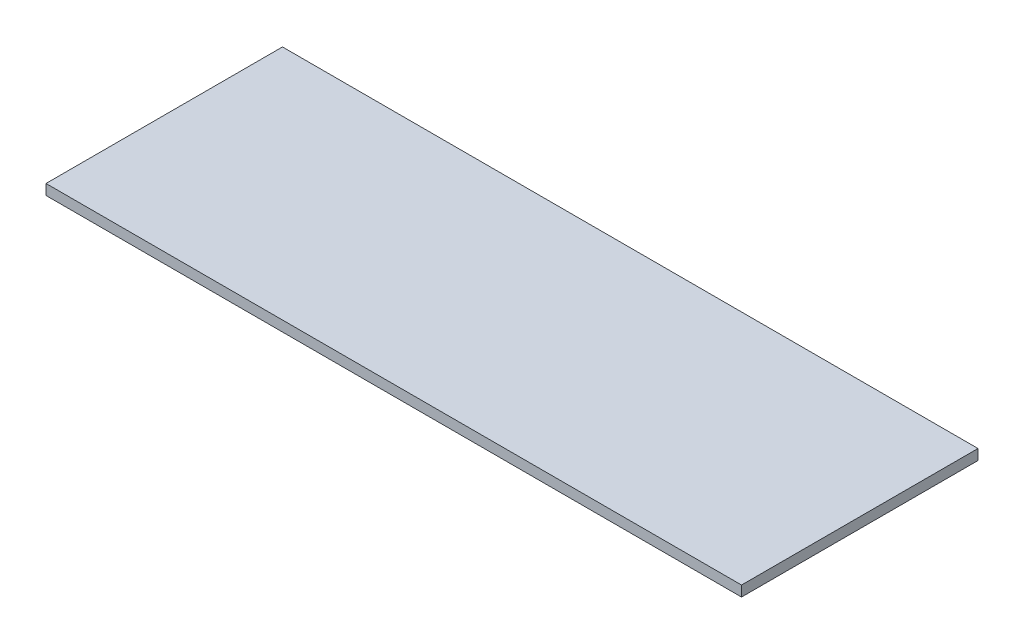
ISO-10303-21;
HEADER;
FILE_DESCRIPTION(('STEP AP214'),'2;1');
FILE_NAME('part.step','',(''),(''),'','','');
FILE_SCHEMA(('AUTOMOTIVE_DESIGN { 1 0 10303 214 1 1 1 1 }'));
ENDSEC;
DATA;
#1=APPLICATION_CONTEXT('core data for automotive mechanical design processes');
#2=APPLICATION_PROTOCOL_DEFINITION('international standard','automotive_design',2000,#1);
#3=PRODUCT_CONTEXT('',#1,'mechanical');
#4=PRODUCT('Part','Part','',(#3));
#5=PRODUCT_RELATED_PRODUCT_CATEGORY('part','',(#4));
#6=PRODUCT_DEFINITION_FORMATION('','',#4);
#7=PRODUCT_DEFINITION_CONTEXT('part definition',#1,'design');
#8=PRODUCT_DEFINITION('design','',#6,#7);
#9=PRODUCT_DEFINITION_SHAPE('','',#8);
#10=(LENGTH_UNIT() NAMED_UNIT(*) SI_UNIT(.MILLI.,.METRE.));
#11=(NAMED_UNIT(*) PLANE_ANGLE_UNIT() SI_UNIT($,.RADIAN.));
#12=(NAMED_UNIT(*) SI_UNIT($,.STERADIAN.) SOLID_ANGLE_UNIT());
#13=UNCERTAINTY_MEASURE_WITH_UNIT(LENGTH_MEASURE(1.E-05),#10,'distance_accuracy_value','');
#14=(GEOMETRIC_REPRESENTATION_CONTEXT(3) GLOBAL_UNCERTAINTY_ASSIGNED_CONTEXT((#13)) GLOBAL_UNIT_ASSIGNED_CONTEXT((#10,
#11,#12)) REPRESENTATION_CONTEXT('',''));
#15=CARTESIAN_POINT('',(0.,0.,0.));
#16=DIRECTION('',(0.,0.,1.));
#17=DIRECTION('',(1.,0.,0.));
#18=AXIS2_PLACEMENT_3D('',#15,#16,#17);
#19=CARTESIAN_POINT('',(-123.083700440529,3.81,-60.9823788546255));
#20=DIRECTION('',(1.,0.,0.));
#21=DIRECTION('',(0.,0.,-1.));
#22=AXIS2_PLACEMENT_3D('',#19,#20,#21);
#23=PLANE('',#22);
#24=DIRECTION('',(0.,0.,1.));
#25=VECTOR('',#24,1.);
#26=CARTESIAN_POINT('',(-123.083700440529,0.,-60.9823788546255));
#27=LINE('',#26,#25);
#28=CARTESIAN_POINT('',(-123.083700440529,0.,-60.9823788546255));
#29=VERTEX_POINT('',#28);
#30=CARTESIAN_POINT('',(-123.083700440529,0.,25.3776211453744));
#31=VERTEX_POINT('',#30);
#32=EDGE_CURVE('E96',#29,#31,#27,.T.);
#33=ORIENTED_EDGE('',*,*,#32,.T.);
#34=DIRECTION('',(0.,-1.,0.));
#35=VECTOR('',#34,1.);
#36=CARTESIAN_POINT('',(-123.083700440529,3.81,25.3776211453744));
#37=LINE('',#36,#35);
#38=CARTESIAN_POINT('',(-123.083700440529,3.81,25.3776211453744));
#39=VERTEX_POINT('',#38);
#40=EDGE_CURVE('E11',#39,#31,#37,.T.);
#41=ORIENTED_EDGE('',*,*,#40,.F.);
#42=DIRECTION('',(0.,0.,1.));
#43=VECTOR('',#42,1.);
#44=CARTESIAN_POINT('',(-123.083700440529,3.81,-60.9823788546255));
#45=LINE('',#44,#43);
#46=CARTESIAN_POINT('',(-123.083700440529,3.81,-60.9823788546255));
#47=VERTEX_POINT('',#46);
#48=EDGE_CURVE('E82',#47,#39,#45,.T.);
#49=ORIENTED_EDGE('',*,*,#48,.F.);
#50=DIRECTION('',(0.,-1.,0.));
#51=VECTOR('',#50,1.);
#52=CARTESIAN_POINT('',(-123.083700440529,3.81,-60.9823788546255));
#53=LINE('',#52,#51);
#54=EDGE_CURVE('E49',#47,#29,#53,.T.);
#55=ORIENTED_EDGE('',*,*,#54,.T.);
#56=EDGE_LOOP('',(#33,#41,#49,#55));
#57=FACE_BOUND('',#56,.T.);
#58=ADVANCED_FACE('F33',(#57),#23,.F.);
#59=CARTESIAN_POINT('',(-123.083700440529,3.81,25.3776211453744));
#60=DIRECTION('',(0.,0.,-1.));
#61=DIRECTION('',(-1.,0.,0.));
#62=AXIS2_PLACEMENT_3D('',#59,#60,#61);
#63=PLANE('',#62);
#64=DIRECTION('',(1.,0.,0.));
#65=VECTOR('',#64,1.);
#66=CARTESIAN_POINT('',(-123.083700440529,0.,25.3776211453744));
#67=LINE('',#66,#65);
#68=CARTESIAN_POINT('',(130.916299559471,0.,25.3776211453744));
#69=VERTEX_POINT('',#68);
#70=EDGE_CURVE('E87',#31,#69,#67,.T.);
#71=ORIENTED_EDGE('',*,*,#70,.T.);
#72=DIRECTION('',(0.,-1.,0.));
#73=VECTOR('',#72,1.);
#74=CARTESIAN_POINT('',(130.916299559471,3.81,25.3776211453744));
#75=LINE('',#74,#73);
#76=CARTESIAN_POINT('',(130.916299559471,3.81,25.3776211453744));
#77=VERTEX_POINT('',#76);
#78=EDGE_CURVE('E41',#77,#69,#75,.T.);
#79=ORIENTED_EDGE('',*,*,#78,.F.);
#80=DIRECTION('',(1.,0.,0.));
#81=VECTOR('',#80,1.);
#82=CARTESIAN_POINT('',(-123.083700440529,3.81,25.3776211453744));
#83=LINE('',#82,#81);
#84=EDGE_CURVE('E74',#39,#77,#83,.T.);
#85=ORIENTED_EDGE('',*,*,#84,.F.);
#86=ORIENTED_EDGE('',*,*,#40,.T.);
#87=EDGE_LOOP('',(#71,#79,#85,#86));
#88=FACE_BOUND('',#87,.T.);
#89=ADVANCED_FACE('F86',(#88),#63,.F.);
#90=CARTESIAN_POINT('',(130.916299559471,3.81,-60.9823788546255));
#91=DIRECTION('',(1.,0.,0.));
#92=DIRECTION('',(0.,0.,-1.));
#93=AXIS2_PLACEMENT_3D('',#90,#91,#92);
#94=PLANE('',#93);
#95=DIRECTION('',(0.,0.,1.));
#96=VECTOR('',#95,1.);
#97=CARTESIAN_POINT('',(130.916299559471,0.,-60.9823788546255));
#98=LINE('',#97,#96);
#99=CARTESIAN_POINT('',(130.916299559471,0.,-60.9823788546255));
#100=VERTEX_POINT('',#99);
#101=EDGE_CURVE('E99',#100,#69,#98,.T.);
#102=ORIENTED_EDGE('',*,*,#101,.F.);
#103=DIRECTION('',(0.,-1.,0.));
#104=VECTOR('',#103,1.);
#105=CARTESIAN_POINT('',(130.916299559471,3.81,-60.9823788546255));
#106=LINE('',#105,#104);
#107=CARTESIAN_POINT('',(130.916299559471,3.81,-60.9823788546255));
#108=VERTEX_POINT('',#107);
#109=EDGE_CURVE('E63',#108,#100,#106,.T.);
#110=ORIENTED_EDGE('',*,*,#109,.F.);
#111=DIRECTION('',(0.,0.,1.));
#112=VECTOR('',#111,1.);
#113=CARTESIAN_POINT('',(130.916299559471,3.81,-60.9823788546255));
#114=LINE('',#113,#112);
#115=EDGE_CURVE('E81',#108,#77,#114,.T.);
#116=ORIENTED_EDGE('',*,*,#115,.T.);
#117=ORIENTED_EDGE('',*,*,#78,.T.);
#118=EDGE_LOOP('',(#102,#110,#116,#117));
#119=FACE_BOUND('',#118,.T.);
#120=ADVANCED_FACE('F90',(#119),#94,.T.);
#121=CARTESIAN_POINT('',(-123.083700440529,3.81,-60.9823788546255));
#122=DIRECTION('',(0.,0.,-1.));
#123=DIRECTION('',(-1.,0.,0.));
#124=AXIS2_PLACEMENT_3D('',#121,#122,#123);
#125=PLANE('',#124);
#126=DIRECTION('',(1.,0.,0.));
#127=VECTOR('',#126,1.);
#128=CARTESIAN_POINT('',(-123.083700440529,0.,-60.9823788546255));
#129=LINE('',#128,#127);
#130=EDGE_CURVE('E101',#29,#100,#129,.T.);
#131=ORIENTED_EDGE('',*,*,#130,.F.);
#132=ORIENTED_EDGE('',*,*,#54,.F.);
#133=DIRECTION('',(1.,0.,0.));
#134=VECTOR('',#133,1.);
#135=CARTESIAN_POINT('',(-123.083700440529,3.81,-60.9823788546255));
#136=LINE('',#135,#134);
#137=EDGE_CURVE('E91',#47,#108,#136,.T.);
#138=ORIENTED_EDGE('',*,*,#137,.T.);
#139=ORIENTED_EDGE('',*,*,#109,.T.);
#140=EDGE_LOOP('',(#131,#132,#138,#139));
#141=FACE_BOUND('',#140,.T.);
#142=ADVANCED_FACE('F107',(#141),#125,.T.);
#143=CARTESIAN_POINT('',(0.,3.81,0.));
#144=DIRECTION('',(0.,1.,0.));
#145=DIRECTION('',(0.,0.,1.));
#146=AXIS2_PLACEMENT_3D('',#143,#144,#145);
#147=PLANE('',#146);
#148=ORIENTED_EDGE('',*,*,#48,.T.);
#149=ORIENTED_EDGE('',*,*,#84,.T.);
#150=ORIENTED_EDGE('',*,*,#115,.F.);
#151=ORIENTED_EDGE('',*,*,#137,.F.);
#152=EDGE_LOOP('',(#148,#149,#150,#151));
#153=FACE_BOUND('',#152,.T.);
#154=ADVANCED_FACE('F78',(#153),#147,.T.);
#155=CARTESIAN_POINT('',(0.,0.,0.));
#156=DIRECTION('',(0.,1.,0.));
#157=DIRECTION('',(0.,0.,1.));
#158=AXIS2_PLACEMENT_3D('',#155,#156,#157);
#159=PLANE('',#158);
#160=ORIENTED_EDGE('',*,*,#32,.F.);
#161=ORIENTED_EDGE('',*,*,#130,.T.);
#162=ORIENTED_EDGE('',*,*,#101,.T.);
#163=ORIENTED_EDGE('',*,*,#70,.F.);
#164=EDGE_LOOP('',(#160,#161,#162,#163));
#165=FACE_BOUND('',#164,.T.);
#166=ADVANCED_FACE('F106',(#165),#159,.F.);
#167=CLOSED_SHELL('',(#58,#89,#120,#142,#154,#166));
#168=MANIFOLD_SOLID_BREP('B2',#167);
#169=ADVANCED_BREP_SHAPE_REPRESENTATION('',(#18,#168),#14);
#170=SHAPE_DEFINITION_REPRESENTATION(#9,#169);
ENDSEC;
END-ISO-10303-21;
